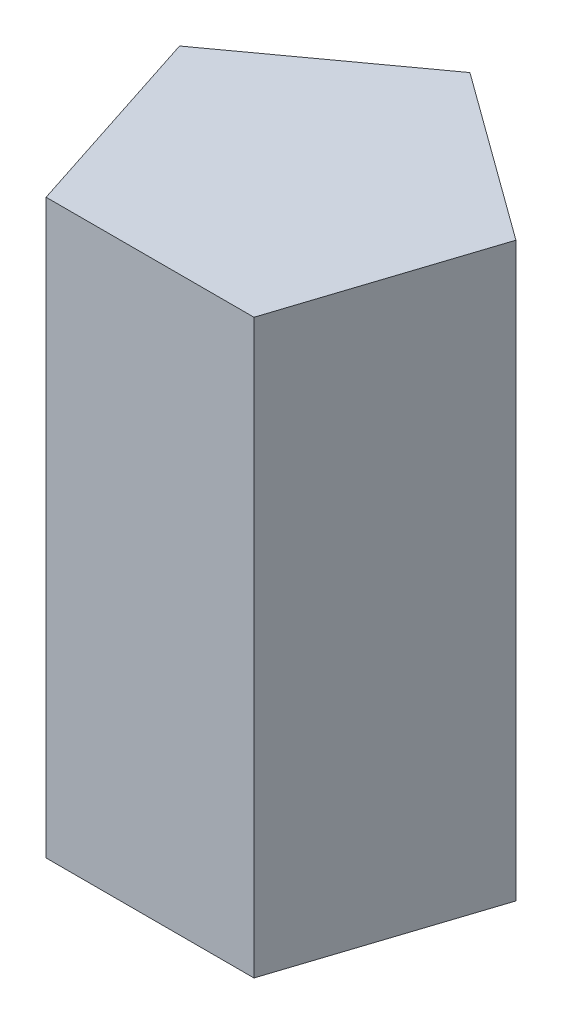
ISO-10303-21;
HEADER;
FILE_DESCRIPTION(('STEP AP214'),'2;1');
FILE_NAME('part.step','',(''),(''),'','','');
FILE_SCHEMA(('AUTOMOTIVE_DESIGN { 1 0 10303 214 1 1 1 1 }'));
ENDSEC;
DATA;
#1=APPLICATION_CONTEXT('core data for automotive mechanical design processes');
#2=APPLICATION_PROTOCOL_DEFINITION('international standard','automotive_design',2000,#1);
#3=PRODUCT_CONTEXT('',#1,'mechanical');
#4=PRODUCT('Part','Part','',(#3));
#5=PRODUCT_RELATED_PRODUCT_CATEGORY('part','',(#4));
#6=PRODUCT_DEFINITION_FORMATION('','',#4);
#7=PRODUCT_DEFINITION_CONTEXT('part definition',#1,'design');
#8=PRODUCT_DEFINITION('design','',#6,#7);
#9=PRODUCT_DEFINITION_SHAPE('','',#8);
#10=(LENGTH_UNIT() NAMED_UNIT(*) SI_UNIT(.MILLI.,.METRE.));
#11=(NAMED_UNIT(*) PLANE_ANGLE_UNIT() SI_UNIT($,.RADIAN.));
#12=(NAMED_UNIT(*) SI_UNIT($,.STERADIAN.) SOLID_ANGLE_UNIT());
#13=UNCERTAINTY_MEASURE_WITH_UNIT(LENGTH_MEASURE(1.E-05),#10,'distance_accuracy_value','');
#14=(GEOMETRIC_REPRESENTATION_CONTEXT(3) GLOBAL_UNCERTAINTY_ASSIGNED_CONTEXT((#13)) GLOBAL_UNIT_ASSIGNED_CONTEXT((#10,
#11,#12)) REPRESENTATION_CONTEXT('',''));
#15=CARTESIAN_POINT('',(0.,0.,0.));
#16=DIRECTION('',(0.,0.,1.));
#17=DIRECTION('',(1.,0.,0.));
#18=AXIS2_PLACEMENT_3D('',#15,#16,#17);
#19=CARTESIAN_POINT('',(3.63271264002681,20.,5.));
#20=DIRECTION('',(-0.951056516295154,0.,-0.309016994374947));
#21=DIRECTION('',(-0.309016994374947,0.,0.951056516295154));
#22=AXIS2_PLACEMENT_3D('',#19,#20,#21);
#23=PLANE('',#22);
#24=DIRECTION('',(0.309016994374947,0.,-0.951056516295154));
#25=VECTOR('',#24,1.);
#26=CARTESIAN_POINT('',(3.63271264002681,0.,5.));
#27=LINE('',#26,#25);
#28=CARTESIAN_POINT('',(3.63271264002681,0.,5.));
#29=VERTEX_POINT('',#28);
#30=CARTESIAN_POINT('',(5.87785252292473,0.,-1.90983005625053));
#31=VERTEX_POINT('',#30);
#32=EDGE_CURVE('E80',#29,#31,#27,.T.);
#33=ORIENTED_EDGE('',*,*,#32,.T.);
#34=DIRECTION('',(0.,-1.,0.));
#35=VECTOR('',#34,1.);
#36=CARTESIAN_POINT('',(5.87785252292473,20.,-1.90983005625053));
#37=LINE('',#36,#35);
#38=CARTESIAN_POINT('',(5.87785252292473,20.,-1.90983005625053));
#39=VERTEX_POINT('',#38);
#40=EDGE_CURVE('E11',#39,#31,#37,.T.);
#41=ORIENTED_EDGE('',*,*,#40,.F.);
#42=DIRECTION('',(0.309016994374947,0.,-0.951056516295154));
#43=VECTOR('',#42,1.);
#44=CARTESIAN_POINT('',(3.63271264002681,20.,5.));
#45=LINE('',#44,#43);
#46=CARTESIAN_POINT('',(3.63271264002681,20.,5.));
#47=VERTEX_POINT('',#46);
#48=EDGE_CURVE('E101',#47,#39,#45,.T.);
#49=ORIENTED_EDGE('',*,*,#48,.F.);
#50=DIRECTION('',(0.,-1.,0.));
#51=VECTOR('',#50,1.);
#52=CARTESIAN_POINT('',(3.63271264002681,20.,5.));
#53=LINE('',#52,#51);
#54=EDGE_CURVE('E93',#47,#29,#53,.T.);
#55=ORIENTED_EDGE('',*,*,#54,.T.);
#56=EDGE_LOOP('',(#33,#41,#49,#55));
#57=FACE_BOUND('',#56,.T.);
#58=ADVANCED_FACE('F30',(#57),#23,.F.);
#59=CARTESIAN_POINT('',(5.87785252292473,20.,-1.90983005625053));
#60=DIRECTION('',(-0.587785252292473,0.,0.809016994374948));
#61=DIRECTION('',(0.809016994374948,0.,0.587785252292473));
#62=AXIS2_PLACEMENT_3D('',#59,#60,#61);
#63=PLANE('',#62);
#64=DIRECTION('',(-0.809016994374948,0.,-0.587785252292473));
#65=VECTOR('',#64,1.);
#66=CARTESIAN_POINT('',(5.87785252292473,0.,-1.90983005625053));
#67=LINE('',#66,#65);
#68=CARTESIAN_POINT('',(0.,0.,-6.18033988749895));
#69=VERTEX_POINT('',#68);
#70=EDGE_CURVE('E76',#31,#69,#67,.T.);
#71=ORIENTED_EDGE('',*,*,#70,.T.);
#72=DIRECTION('',(0.,-1.,0.));
#73=VECTOR('',#72,1.);
#74=CARTESIAN_POINT('',(0.,20.,-6.18033988749895));
#75=LINE('',#74,#73);
#76=CARTESIAN_POINT('',(0.,20.,-6.18033988749895));
#77=VERTEX_POINT('',#76);
#78=EDGE_CURVE('E37',#77,#69,#75,.T.);
#79=ORIENTED_EDGE('',*,*,#78,.F.);
#80=DIRECTION('',(-0.809016994374948,0.,-0.587785252292473));
#81=VECTOR('',#80,1.);
#82=CARTESIAN_POINT('',(5.87785252292473,20.,-1.90983005625053));
#83=LINE('',#82,#81);
#84=EDGE_CURVE('E89',#39,#77,#83,.T.);
#85=ORIENTED_EDGE('',*,*,#84,.F.);
#86=ORIENTED_EDGE('',*,*,#40,.T.);
#87=EDGE_LOOP('',(#71,#79,#85,#86));
#88=FACE_BOUND('',#87,.T.);
#89=ADVANCED_FACE('F88',(#88),#63,.F.);
#90=CARTESIAN_POINT('',(0.,20.,-6.18033988749895));
#91=DIRECTION('',(0.587785252292473,0.,0.809016994374947));
#92=DIRECTION('',(0.809016994374947,0.,-0.587785252292473));
#93=AXIS2_PLACEMENT_3D('',#90,#91,#92);
#94=PLANE('',#93);
#95=DIRECTION('',(-0.809016994374947,0.,0.587785252292473));
#96=VECTOR('',#95,1.);
#97=CARTESIAN_POINT('',(0.,0.,-6.18033988749895));
#98=LINE('',#97,#96);
#99=CARTESIAN_POINT('',(-5.87785252292473,0.,-1.90983005625053));
#100=VERTEX_POINT('',#99);
#101=EDGE_CURVE('E82',#69,#100,#98,.T.);
#102=ORIENTED_EDGE('',*,*,#101,.T.);
#103=DIRECTION('',(0.,-1.,0.));
#104=VECTOR('',#103,1.);
#105=CARTESIAN_POINT('',(-5.87785252292473,20.,-1.90983005625053));
#106=LINE('',#105,#104);
#107=CARTESIAN_POINT('',(-5.87785252292473,20.,-1.90983005625053));
#108=VERTEX_POINT('',#107);
#109=EDGE_CURVE('E112',#108,#100,#106,.T.);
#110=ORIENTED_EDGE('',*,*,#109,.F.);
#111=DIRECTION('',(-0.809016994374947,0.,0.587785252292473));
#112=VECTOR('',#111,1.);
#113=CARTESIAN_POINT('',(0.,20.,-6.18033988749895));
#114=LINE('',#113,#112);
#115=EDGE_CURVE('E104',#77,#108,#114,.T.);
#116=ORIENTED_EDGE('',*,*,#115,.F.);
#117=ORIENTED_EDGE('',*,*,#78,.T.);
#118=EDGE_LOOP('',(#102,#110,#116,#117));
#119=FACE_BOUND('',#118,.T.);
#120=ADVANCED_FACE('F116',(#119),#94,.F.);
#121=CARTESIAN_POINT('',(-5.87785252292473,20.,-1.90983005625053));
#122=DIRECTION('',(0.951056516295154,0.,-0.309016994374947));
#123=DIRECTION('',(-0.309016994374947,0.,-0.951056516295154));
#124=AXIS2_PLACEMENT_3D('',#121,#122,#123);
#125=PLANE('',#124);
#126=DIRECTION('',(0.309016994374947,0.,0.951056516295154));
#127=VECTOR('',#126,1.);
#128=CARTESIAN_POINT('',(-5.87785252292473,0.,-1.90983005625053));
#129=LINE('',#128,#127);
#130=CARTESIAN_POINT('',(-3.6327126400268,0.,5.));
#131=VERTEX_POINT('',#130);
#132=EDGE_CURVE('E97',#100,#131,#129,.T.);
#133=ORIENTED_EDGE('',*,*,#132,.T.);
#134=DIRECTION('',(0.,-1.,0.));
#135=VECTOR('',#134,1.);
#136=CARTESIAN_POINT('',(-3.6327126400268,20.,5.));
#137=LINE('',#136,#135);
#138=CARTESIAN_POINT('',(-3.6327126400268,20.,5.));
#139=VERTEX_POINT('',#138);
#140=EDGE_CURVE('E109',#139,#131,#137,.T.);
#141=ORIENTED_EDGE('',*,*,#140,.F.);
#142=DIRECTION('',(0.309016994374947,0.,0.951056516295154));
#143=VECTOR('',#142,1.);
#144=CARTESIAN_POINT('',(-5.87785252292473,20.,-1.90983005625053));
#145=LINE('',#144,#143);
#146=EDGE_CURVE('E49',#108,#139,#145,.T.);
#147=ORIENTED_EDGE('',*,*,#146,.F.);
#148=ORIENTED_EDGE('',*,*,#109,.T.);
#149=EDGE_LOOP('',(#133,#141,#147,#148));
#150=FACE_BOUND('',#149,.T.);
#151=ADVANCED_FACE('F127',(#150),#125,.F.);
#152=CARTESIAN_POINT('',(-3.6327126400268,20.,5.));
#153=DIRECTION('',(0.,0.,-1.));
#154=DIRECTION('',(-1.,0.,0.));
#155=AXIS2_PLACEMENT_3D('',#152,#153,#154);
#156=PLANE('',#155);
#157=DIRECTION('',(1.,0.,0.));
#158=VECTOR('',#157,1.);
#159=CARTESIAN_POINT('',(-3.6327126400268,0.,5.));
#160=LINE('',#159,#158);
#161=EDGE_CURVE('E99',#131,#29,#160,.T.);
#162=ORIENTED_EDGE('',*,*,#161,.T.);
#163=ORIENTED_EDGE('',*,*,#54,.F.);
#164=DIRECTION('',(1.,0.,0.));
#165=VECTOR('',#164,1.);
#166=CARTESIAN_POINT('',(-3.6327126400268,20.,5.));
#167=LINE('',#166,#165);
#168=EDGE_CURVE('E44',#139,#47,#167,.T.);
#169=ORIENTED_EDGE('',*,*,#168,.F.);
#170=ORIENTED_EDGE('',*,*,#140,.T.);
#171=EDGE_LOOP('',(#162,#163,#169,#170));
#172=FACE_BOUND('',#171,.T.);
#173=ADVANCED_FACE('F120',(#172),#156,.F.);
#174=CARTESIAN_POINT('',(5.87785252292473,20.,-1.90983005625053));
#175=DIRECTION('',(0.,1.,0.));
#176=DIRECTION('',(0.,0.,1.));
#177=AXIS2_PLACEMENT_3D('',#174,#175,#176);
#178=PLANE('',#177);
#179=ORIENTED_EDGE('',*,*,#48,.T.);
#180=ORIENTED_EDGE('',*,*,#84,.T.);
#181=ORIENTED_EDGE('',*,*,#115,.T.);
#182=ORIENTED_EDGE('',*,*,#146,.T.);
#183=ORIENTED_EDGE('',*,*,#168,.T.);
#184=EDGE_LOOP('',(#179,#180,#181,#182,#183));
#185=FACE_BOUND('',#184,.T.);
#186=ADVANCED_FACE('F118',(#185),#178,.T.);
#187=CARTESIAN_POINT('',(5.87785252292473,0.,-1.90983005625053));
#188=DIRECTION('',(0.,1.,0.));
#189=DIRECTION('',(0.,0.,1.));
#190=AXIS2_PLACEMENT_3D('',#187,#188,#189);
#191=PLANE('',#190);
#192=ORIENTED_EDGE('',*,*,#32,.F.);
#193=ORIENTED_EDGE('',*,*,#161,.F.);
#194=ORIENTED_EDGE('',*,*,#132,.F.);
#195=ORIENTED_EDGE('',*,*,#101,.F.);
#196=ORIENTED_EDGE('',*,*,#70,.F.);
#197=EDGE_LOOP('',(#192,#193,#194,#195,#196));
#198=FACE_BOUND('',#197,.T.);
#199=ADVANCED_FACE('F77',(#198),#191,.F.);
#200=CLOSED_SHELL('',(#58,#89,#120,#151,#173,#186,#199));
#201=MANIFOLD_SOLID_BREP('B2',#200);
#202=ADVANCED_BREP_SHAPE_REPRESENTATION('',(#18,#201),#14);
#203=SHAPE_DEFINITION_REPRESENTATION(#9,#202);
ENDSEC;
END-ISO-10303-21;
